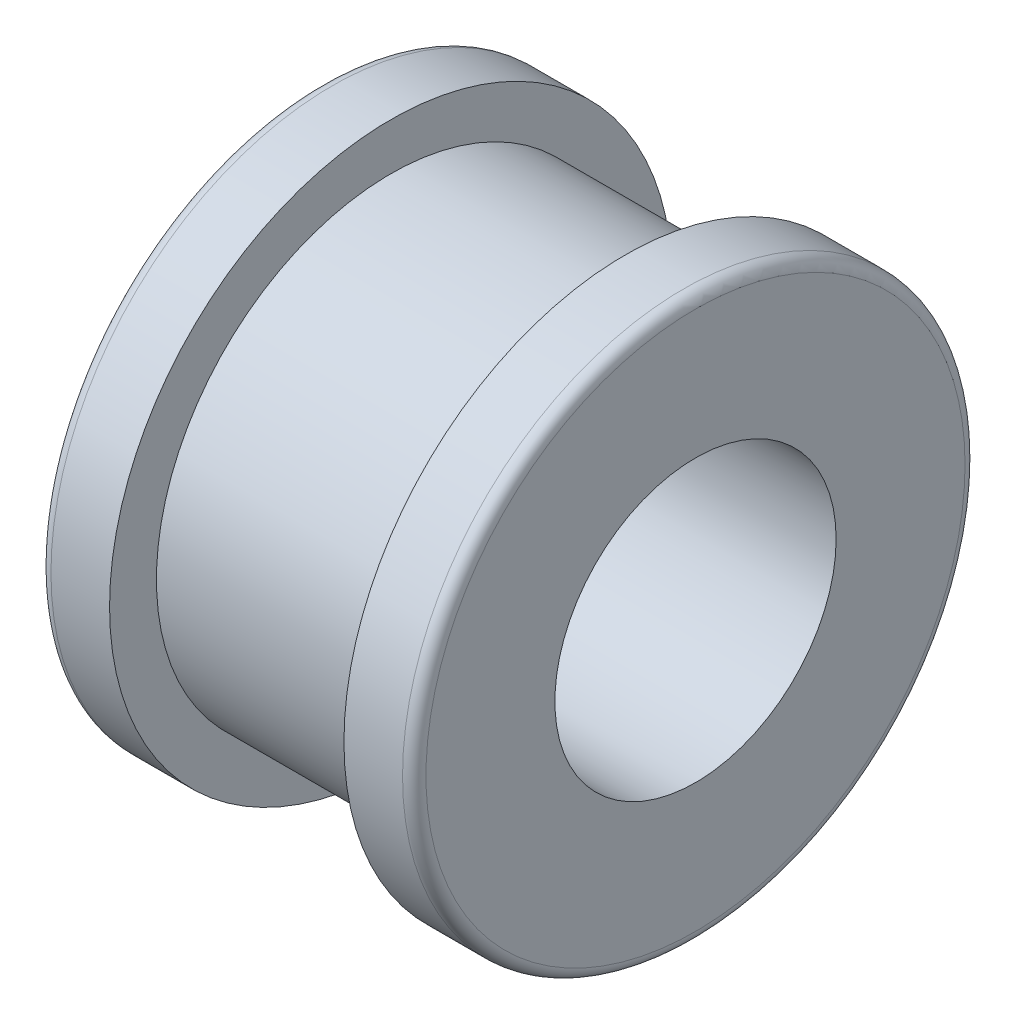
ISO-10303-21;
HEADER;
FILE_DESCRIPTION(('STEP AP214'),'2;1');
FILE_NAME('part.step','',(''),(''),'','','');
FILE_SCHEMA(('AUTOMOTIVE_DESIGN { 1 0 10303 214 1 1 1 1 }'));
ENDSEC;
DATA;
#1=APPLICATION_CONTEXT('core data for automotive mechanical design processes');
#2=APPLICATION_PROTOCOL_DEFINITION('international standard','automotive_design',2000,#1);
#3=PRODUCT_CONTEXT('',#1,'mechanical');
#4=PRODUCT('Part','Part','',(#3));
#5=PRODUCT_RELATED_PRODUCT_CATEGORY('part','',(#4));
#6=PRODUCT_DEFINITION_FORMATION('','',#4);
#7=PRODUCT_DEFINITION_CONTEXT('part definition',#1,'design');
#8=PRODUCT_DEFINITION('design','',#6,#7);
#9=PRODUCT_DEFINITION_SHAPE('','',#8);
#10=(LENGTH_UNIT() NAMED_UNIT(*) SI_UNIT(.MILLI.,.METRE.));
#11=(NAMED_UNIT(*) PLANE_ANGLE_UNIT() SI_UNIT($,.RADIAN.));
#12=(NAMED_UNIT(*) SI_UNIT($,.STERADIAN.) SOLID_ANGLE_UNIT());
#13=UNCERTAINTY_MEASURE_WITH_UNIT(LENGTH_MEASURE(1.E-05),#10,'distance_accuracy_value','');
#14=(GEOMETRIC_REPRESENTATION_CONTEXT(3) GLOBAL_UNCERTAINTY_ASSIGNED_CONTEXT((#13)) GLOBAL_UNIT_ASSIGNED_CONTEXT((#10,
#11,#12)) REPRESENTATION_CONTEXT('',''));
#15=CARTESIAN_POINT('',(0.,0.,0.));
#16=DIRECTION('',(0.,0.,1.));
#17=DIRECTION('',(1.,0.,0.));
#18=AXIS2_PLACEMENT_3D('',#15,#16,#17);
#19=CARTESIAN_POINT('',(8.,0.,0.));
#20=DIRECTION('',(-1.,0.,0.));
#21=DIRECTION('',(0.,0.,1.));
#22=AXIS2_PLACEMENT_3D('',#19,#20,#21);
#23=CYLINDRICAL_SURFACE('',#22,12.);
#24=CARTESIAN_POINT('',(-7.5,0.,0.));
#25=DIRECTION('',(1.,0.,0.));
#26=DIRECTION('',(0.,0.,-1.));
#27=AXIS2_PLACEMENT_3D('',#24,#25,#26);
#28=CIRCLE('',#27,12.);
#29=CARTESIAN_POINT('',(-7.5,0.,-12.));
#30=VERTEX_POINT('',#29);
#31=EDGE_CURVE('E54',#30,#30,#28,.T.);
#32=ORIENTED_EDGE('',*,*,#31,.T.);
#33=EDGE_LOOP('',(#32));
#34=FACE_BOUND('',#33,.T.);
#35=CARTESIAN_POINT('',(-5.,0.,0.));
#36=DIRECTION('',(1.,0.,0.));
#37=DIRECTION('',(0.,0.,-1.));
#38=AXIS2_PLACEMENT_3D('',#35,#36,#37);
#39=CIRCLE('',#38,12.);
#40=CARTESIAN_POINT('',(-5.,0.,-12.));
#41=VERTEX_POINT('',#40);
#42=EDGE_CURVE('E69',#41,#41,#39,.T.);
#43=ORIENTED_EDGE('',*,*,#42,.F.);
#44=EDGE_LOOP('',(#43));
#45=FACE_BOUND('',#44,.T.);
#46=ADVANCED_FACE('F40',(#34,#45),#23,.T.);
#47=CARTESIAN_POINT('',(-8.,0.,0.));
#48=DIRECTION('',(1.,0.,0.));
#49=DIRECTION('',(0.,0.,-1.));
#50=AXIS2_PLACEMENT_3D('',#47,#48,#49);
#51=PLANE('',#50);
#52=CARTESIAN_POINT('',(-8.,0.,0.));
#53=DIRECTION('',(1.,0.,0.));
#54=DIRECTION('',(0.,0.,-1.));
#55=AXIS2_PLACEMENT_3D('',#52,#53,#54);
#56=CIRCLE('',#55,11.5);
#57=CARTESIAN_POINT('',(-8.,0.,-11.5));
#58=VERTEX_POINT('',#57);
#59=EDGE_CURVE('E10',#58,#58,#56,.F.);
#60=ORIENTED_EDGE('',*,*,#59,.T.);
#61=EDGE_LOOP('',(#60));
#62=FACE_BOUND('',#61,.T.);
#63=CARTESIAN_POINT('',(-8.,0.,0.));
#64=DIRECTION('',(1.,0.,0.));
#65=DIRECTION('',(0.,0.,-1.));
#66=AXIS2_PLACEMENT_3D('',#63,#64,#65);
#67=CIRCLE('',#66,6.);
#68=CARTESIAN_POINT('',(-8.,0.,-6.));
#69=VERTEX_POINT('',#68);
#70=EDGE_CURVE('E82',#69,#69,#67,.T.);
#71=ORIENTED_EDGE('',*,*,#70,.T.);
#72=EDGE_LOOP('',(#71));
#73=FACE_BOUND('',#72,.T.);
#74=ADVANCED_FACE('F126',(#62,#73),#51,.F.);
#75=CARTESIAN_POINT('',(-5.,0.,0.));
#76=DIRECTION('',(1.,0.,0.));
#77=DIRECTION('',(0.,0.,-1.));
#78=AXIS2_PLACEMENT_3D('',#75,#76,#77);
#79=PLANE('',#78);
#80=CARTESIAN_POINT('',(-5.,0.,0.));
#81=DIRECTION('',(1.,0.,0.));
#82=DIRECTION('',(0.,0.,-1.));
#83=AXIS2_PLACEMENT_3D('',#80,#81,#82);
#84=CIRCLE('',#83,10.);
#85=CARTESIAN_POINT('',(-5.,0.,-10.));
#86=VERTEX_POINT('',#85);
#87=EDGE_CURVE('E74',#86,#86,#84,.T.);
#88=ORIENTED_EDGE('',*,*,#87,.F.);
#89=EDGE_LOOP('',(#88));
#90=FACE_BOUND('',#89,.T.);
#91=ORIENTED_EDGE('',*,*,#42,.T.);
#92=EDGE_LOOP('',(#91));
#93=FACE_BOUND('',#92,.T.);
#94=ADVANCED_FACE('F132',(#90,#93),#79,.T.);
#95=CARTESIAN_POINT('',(5.,0.,0.));
#96=DIRECTION('',(1.,0.,0.));
#97=DIRECTION('',(0.,0.,-1.));
#98=AXIS2_PLACEMENT_3D('',#95,#96,#97);
#99=PLANE('',#98);
#100=CARTESIAN_POINT('',(5.,0.,0.));
#101=DIRECTION('',(1.,0.,0.));
#102=DIRECTION('',(0.,0.,-1.));
#103=AXIS2_PLACEMENT_3D('',#100,#101,#102);
#104=CIRCLE('',#103,10.);
#105=CARTESIAN_POINT('',(5.,0.,-10.));
#106=VERTEX_POINT('',#105);
#107=EDGE_CURVE('E78',#106,#106,#104,.T.);
#108=ORIENTED_EDGE('',*,*,#107,.T.);
#109=EDGE_LOOP('',(#108));
#110=FACE_BOUND('',#109,.T.);
#111=CARTESIAN_POINT('',(5.,0.,0.));
#112=DIRECTION('',(1.,0.,0.));
#113=DIRECTION('',(0.,0.,-1.));
#114=AXIS2_PLACEMENT_3D('',#111,#112,#113);
#115=CIRCLE('',#114,12.);
#116=CARTESIAN_POINT('',(5.,0.,-12.));
#117=VERTEX_POINT('',#116);
#118=EDGE_CURVE('E70',#117,#117,#115,.T.);
#119=ORIENTED_EDGE('',*,*,#118,.F.);
#120=EDGE_LOOP('',(#119));
#121=FACE_BOUND('',#120,.T.);
#122=ADVANCED_FACE('F139',(#110,#121),#99,.F.);
#123=CARTESIAN_POINT('',(-5.,0.,0.));
#124=DIRECTION('',(1.,0.,0.));
#125=DIRECTION('',(0.,0.,-1.));
#126=AXIS2_PLACEMENT_3D('',#123,#124,#125);
#127=CYLINDRICAL_SURFACE('',#126,10.);
#128=CARTESIAN_POINT('',(1.,-10.,0.));
#129=CARTESIAN_POINT('',(0.99999757409962,-9.99999935520769,0.0560203537915572));
#130=CARTESIAN_POINT('',(0.995276731103556,-9.99952425596206,0.112077745167773));
#131=CARTESIAN_POINT('',(0.976515629709573,-9.99767467594738,0.222638398496837));
#132=CARTESIAN_POINT('',(0.962465103975411,-9.99629920434026,0.277139879168828));
#133=CARTESIAN_POINT('',(0.925457759402168,-9.9928041456307,0.382971675453414));
#134=CARTESIAN_POINT('',(0.902506319481526,-9.99068500800708,0.434303884614909));
#135=CARTESIAN_POINT('',(0.848359092068356,-9.98593957394306,0.532376160960406));
#136=CARTESIAN_POINT('',(0.817164943999862,-9.98331337838132,0.579117138779076));
#137=CARTESIAN_POINT('',(0.747297302337726,-9.97783744341324,0.666859550674082));
#138=CARTESIAN_POINT('',(0.708600200597966,-9.97498701573866,0.707842144834892));
#139=CARTESIAN_POINT('',(0.62487546573697,-9.96938956906263,0.782742521430984));
#140=CARTESIAN_POINT('',(0.579847539957613,-9.96664255484917,0.816659977082653));
#141=CARTESIAN_POINT('',(0.484621468316379,-9.96155591552784,0.876533970443617));
#142=CARTESIAN_POINT('',(0.434412555905142,-9.95921716710905,0.902473465454879));
#143=CARTESIAN_POINT('',(0.330324414095021,-9.95522037546525,0.94554638474276));
#144=CARTESIAN_POINT('',(0.27644527541605,-9.95356231542222,0.962680026591291));
#145=CARTESIAN_POINT('',(0.166738199133991,-9.95112084072978,0.987599041601893));
#146=CARTESIAN_POINT('',(0.110917423147792,-9.95033450398097,0.995415653003795));
#147=CARTESIAN_POINT('',(-0.00124886339578044,-9.94971643060526,1.00157528513536));
#148=CARTESIAN_POINT('',(-0.0575943601220591,-9.94988466888746,0.999918554870802));
#149=CARTESIAN_POINT('',(-0.168995309693318,-9.95115406898935,0.987204280252678));
#150=CARTESIAN_POINT('',(-0.224054699328694,-9.95225184590651,0.976180844124552));
#151=CARTESIAN_POINT('',(-0.331537963201094,-9.95525134287419,0.945099144150586));
#152=CARTESIAN_POINT('',(-0.383961801825031,-9.95715307378492,0.925040758255746));
#153=CARTESIAN_POINT('',(-0.484793587298889,-9.9615500945207,0.876420893881507));
#154=CARTESIAN_POINT('',(-0.533194189489316,-9.96404643908158,0.84784428271998));
#155=CARTESIAN_POINT('',(-0.624525214911882,-9.96935051732879,0.783010027353227));
#156=CARTESIAN_POINT('',(-0.667455477981763,-9.97215826012785,0.746752158336505));
#157=CARTESIAN_POINT('',(-0.746825393989027,-9.9777838531299,0.667394112412069));
#158=CARTESIAN_POINT('',(-0.783235601880805,-9.98060169332997,0.624264478851363));
#159=CARTESIAN_POINT('',(-0.848303632910388,-9.98591829078518,0.532489481737112));
#160=CARTESIAN_POINT('',(-0.876961447356476,-9.98841704768256,0.483844111999601));
#161=CARTESIAN_POINT('',(-0.925710020310253,-9.99281475667096,0.382398105692365));
#162=CARTESIAN_POINT('',(-0.945799284818062,-9.9947136041477,0.329596746389903));
#163=CARTESIAN_POINT('',(-0.976818916711752,-9.99769647441409,0.221347217329932));
#164=CARTESIAN_POINT('',(-0.987749557990623,-9.99878052157063,0.1658991267766));
#165=CARTESIAN_POINT('',(-1.00010430773477,-10.0000085166831,0.0541850990919041));
#166=CARTESIAN_POINT('',(-1.0015690482525,-10.0001564826774,-0.00207630210549165));
#167=CARTESIAN_POINT('',(-0.995057136951236,-9.99950641756797,-0.114043793315699));
#168=CARTESIAN_POINT('',(-0.98708061268472,-9.99870839924468,-0.16974989082047));
#169=CARTESIAN_POINT('',(-0.961946304578424,-9.99625861539194,-0.278908206834674));
#170=CARTESIAN_POINT('',(-0.944807545521989,-9.99460861918039,-0.332364848972019));
#171=CARTESIAN_POINT('',(-0.901854825962729,-9.99063998860609,-0.435644321383781));
#172=CARTESIAN_POINT('',(-0.876040670960603,-9.98832133925254,-0.485467070157117));
#173=CARTESIAN_POINT('',(-0.816369161336087,-9.98326475330422,-0.580248180172142));
#174=CARTESIAN_POINT('',(-0.782485111074183,-9.98052543603441,-0.625189659748917));
#175=CARTESIAN_POINT('',(-0.707673932259073,-9.9749393286952,-0.708761623311878));
#176=CARTESIAN_POINT('',(-0.666746626929683,-9.97209253592971,-0.747391948849177));
#177=CARTESIAN_POINT('',(-0.578833425340999,-9.96660024140755,-0.817386109887145));
#178=CARTESIAN_POINT('',(-0.531826243457378,-9.96395550138975,-0.848723278679543));
#179=CARTESIAN_POINT('',(-0.433192639853315,-9.9591783246089,-0.903058258743828));
#180=CARTESIAN_POINT('',(-0.381566281311604,-9.95704588084038,-0.926056184053882));
#181=CARTESIAN_POINT('',(-0.275251260534206,-9.9535394763405,-0.963015208684475));
#182=CARTESIAN_POINT('',(-0.220568159908879,-9.95216418449789,-0.976992174811861));
#183=CARTESIAN_POINT('',(-0.109616802039228,-9.95032365282877,-0.995564007129462));
#184=CARTESIAN_POINT('',(-0.0533485903043259,-9.94985838690186,-1.00015914239952));
#185=CARTESIAN_POINT('',(0.0589106883567047,-9.94989113107562,-0.999833138471256));
#186=CARTESIAN_POINT('',(0.114901882882815,-9.95038490087009,-0.994953889593112));
#187=CARTESIAN_POINT('',(0.225264917168288,-9.95227103889546,-0.975905452963653));
#188=CARTESIAN_POINT('',(0.27963675510598,-9.95366340813719,-0.96173625476216));
#189=CARTESIAN_POINT('',(0.385217349047857,-9.95718868263187,-0.924521686297503));
#190=CARTESIAN_POINT('',(0.436426541629725,-9.95932148540361,-0.901477544340916));
#191=CARTESIAN_POINT('',(0.534256891671035,-9.96408751839359,-0.847171554911043));
#192=CARTESIAN_POINT('',(0.58087807482063,-9.96672074580951,-0.815909753455415));
#193=CARTESIAN_POINT('',(0.668423674471935,-9.97220487209698,-0.745898556285331));
#194=CARTESIAN_POINT('',(0.709323076367086,-9.97505664726751,-0.707117948890268));
#195=CARTESIAN_POINT('',(0.784052232699658,-9.98064854728783,-0.623231699225109));
#196=CARTESIAN_POINT('',(0.81788029135717,-9.98338864522976,-0.578124544108257));
#197=CARTESIAN_POINT('',(0.877573453854621,-9.98845562069162,-0.482741434161289));
#198=CARTESIAN_POINT('',(0.903418290945183,-9.99078144026812,-0.432452749346764));
#199=CARTESIAN_POINT('',(0.946262422823868,-9.99474629249896,-0.328258279100551));
#200=CARTESIAN_POINT('',(0.963271690953547,-9.99638609909654,-0.274356649825609));
#201=CARTESIAN_POINT('',(0.983720617084802,-9.99838213773734,-0.183458261405704));
#202=CARTESIAN_POINT('',(0.989817044299357,-9.99898600691833,-0.147042552844509));
#203=CARTESIAN_POINT('',(0.997957526061762,-9.99979514950786,-0.073756580817313));
#204=CARTESIAN_POINT('',(1.00000159732186,-10.0000004245602,-0.0368863192265578));
#205=CARTESIAN_POINT('',(1.,-10.,0.));
#206=B_SPLINE_CURVE_WITH_KNOTS('',3,(#128,#129,#130,#131,#132,#133,#134,#135,#136,#137,#138,
#139,#140,#141,#142,#143,#144,#145,#146,#147,#148,#149,#150,#151,#152,#153,#154,#155,#156,#157,
#158,#159,#160,#161,#162,#163,#164,#165,#166,#167,#168,#169,#170,#171,#172,#173,#174,#175,#176,
#177,#178,#179,#180,#181,#182,#183,#184,#185,#186,#187,#188,#189,#190,#191,#192,#193,#194,#195,
#196,#197,#198,#199,#200,#201,#202,#203,#204,#205),.UNSPECIFIED.,.T.,.F.,(4,2,2,2,2,2,2,2,2,2,2,
2,2,2,2,2,2,2,2,2,2,2,2,2,2,2,2,2,2,2,2,2,2,2,2,2,2,2,4),(0.,0.167926366268474,
0.336037842835486,0.504047885732202,0.672024537582782,0.840538568622945,1.00906039220706,
1.17793975472222,1.34681494442504,1.51512232045197,1.68342527255776,1.8511179744111,
2.01881294161634,2.18680761372895,2.35480720331125,2.52354734196207,2.69228766979772,
2.86105740693581,3.02982209675439,3.19786188607758,3.36589940519143,3.53358935294305,
3.70128306049467,3.86953940748698,4.0377999781023,4.20666643608598,4.37553058475374,
4.54409690593003,4.71265839239585,4.88047629293956,5.04829438226039,5.216089253628,
5.3838831853896,5.55238917427653,5.72093552636958,5.88990631026242,6.05868594795295,
6.16925667232348,6.27982694069027),.UNSPECIFIED.);
#207=CARTESIAN_POINT('',(1.,-10.,0.));
#208=VERTEX_POINT('',#207);
#209=EDGE_CURVE('E93',#208,#208,#206,.T.);
#210=ORIENTED_EDGE('',*,*,#209,.F.);
#211=EDGE_LOOP('',(#210));
#212=FACE_BOUND('',#211,.T.);
#213=ORIENTED_EDGE('',*,*,#87,.T.);
#214=EDGE_LOOP('',(#213));
#215=FACE_BOUND('',#214,.T.);
#216=ORIENTED_EDGE('',*,*,#107,.F.);
#217=EDGE_LOOP('',(#216));
#218=FACE_BOUND('',#217,.T.);
#219=ADVANCED_FACE('F100',(#212,#215,#218),#127,.T.);
#220=CARTESIAN_POINT('',(8.,0.,0.));
#221=DIRECTION('',(1.,0.,0.));
#222=DIRECTION('',(0.,0.,-1.));
#223=AXIS2_PLACEMENT_3D('',#220,#221,#222);
#224=PLANE('',#223);
#225=CARTESIAN_POINT('',(8.,0.,0.));
#226=DIRECTION('',(1.,0.,0.));
#227=DIRECTION('',(0.,0.,-1.));
#228=AXIS2_PLACEMENT_3D('',#225,#226,#227);
#229=CIRCLE('',#228,11.5);
#230=CARTESIAN_POINT('',(8.,0.,-11.5));
#231=VERTEX_POINT('',#230);
#232=EDGE_CURVE('E65',#231,#231,#229,.T.);
#233=ORIENTED_EDGE('',*,*,#232,.T.);
#234=EDGE_LOOP('',(#233));
#235=FACE_BOUND('',#234,.T.);
#236=CARTESIAN_POINT('',(8.,0.,0.));
#237=DIRECTION('',(1.,0.,0.));
#238=DIRECTION('',(0.,0.,-1.));
#239=AXIS2_PLACEMENT_3D('',#236,#237,#238);
#240=CIRCLE('',#239,6.);
#241=CARTESIAN_POINT('',(8.,0.,-6.));
#242=VERTEX_POINT('',#241);
#243=EDGE_CURVE('E89',#242,#242,#240,.T.);
#244=ORIENTED_EDGE('',*,*,#243,.F.);
#245=EDGE_LOOP('',(#244));
#246=FACE_BOUND('',#245,.T.);
#247=ADVANCED_FACE('F120',(#235,#246),#224,.T.);
#248=CARTESIAN_POINT('',(7.5,0.,0.));
#249=DIRECTION('',(1.,0.,0.));
#250=DIRECTION('',(0.,0.,-1.));
#251=AXIS2_PLACEMENT_3D('',#248,#249,#250);
#252=CIRCLE('',#251,12.);
#253=CARTESIAN_POINT('',(7.5,0.,-12.));
#254=VERTEX_POINT('',#253);
#255=EDGE_CURVE('E59',#254,#254,#252,.F.);
#256=ORIENTED_EDGE('',*,*,#255,.T.);
#257=EDGE_LOOP('',(#256));
#258=FACE_BOUND('',#257,.T.);
#259=ORIENTED_EDGE('',*,*,#118,.T.);
#260=EDGE_LOOP('',(#259));
#261=FACE_BOUND('',#260,.T.);
#262=ADVANCED_FACE('F112',(#258,#261),#23,.T.);
#263=CARTESIAN_POINT('',(-8.,0.,0.));
#264=DIRECTION('',(1.,0.,0.));
#265=DIRECTION('',(0.,0.,-1.));
#266=AXIS2_PLACEMENT_3D('',#263,#264,#265);
#267=CYLINDRICAL_SURFACE('',#266,6.);
#268=CARTESIAN_POINT('',(0.,-5.91607978309962,1.));
#269=CARTESIAN_POINT('',(-0.0557502992584118,-5.91608078960511,0.999997759368402));
#270=CARTESIAN_POINT('',(-0.111531042409948,-5.91687637019227,0.995322067614928));
#271=CARTESIAN_POINT('',(-0.221527417288066,-5.91996982947271,0.976750971230157));
#272=CARTESIAN_POINT('',(-0.27574155749981,-5.92226909356571,0.962847064123861));
#273=CARTESIAN_POINT('',(-0.380996913342711,-5.9281024372893,0.926251817466857));
#274=CARTESIAN_POINT('',(-0.432040739466525,-5.9316354846878,0.903567821972435));
#275=CARTESIAN_POINT('',(-0.529592381885484,-5.93953708845736,0.850074598756146));
#276=CARTESIAN_POINT('',(-0.576100707830495,-5.94390555078989,0.819266285400627));
#277=CARTESIAN_POINT('',(-0.663725139898267,-5.95303388461044,0.75007501078652));
#278=CARTESIAN_POINT('',(-0.704790052554605,-5.95779686930827,0.711627619572909));
#279=CARTESIAN_POINT('',(-0.779917322744606,-5.96714992267783,0.628388801878136));
#280=CARTESIAN_POINT('',(-0.813979265246135,-5.97173998108788,0.583596999659995));
#281=CARTESIAN_POINT('',(-0.874325826887742,-5.98026294792988,0.488609147979335));
#282=CARTESIAN_POINT('',(-0.90056280309273,-5.98419176972911,0.438382432582681));
#283=CARTESIAN_POINT('',(-0.944208428212213,-5.99091494782862,0.334158248689549));
#284=CARTESIAN_POINT('',(-0.961617651153948,-5.9937093778907,0.280161025631276));
#285=CARTESIAN_POINT('',(-0.986957013993562,-5.99782693889752,0.170457490537697));
#286=CARTESIAN_POINT('',(-0.994973166401878,-5.99916341244362,0.114771554671708));
#287=CARTESIAN_POINT('',(-1.00156630166104,-6.00026031737113,0.00283011421031905));
#288=CARTESIAN_POINT('',(-1.00014392609889,-6.00002085587723,-0.0534253514115594));
#289=CARTESIAN_POINT('',(-0.987967459388716,-5.99800343372556,-0.16432087403155));
#290=CARTESIAN_POINT('',(-0.977305934636339,-5.99624073476959,-0.218971412280056));
#291=CARTESIAN_POINT('',(-0.947099570301403,-5.99139191508655,-0.325696791844717));
#292=CARTESIAN_POINT('',(-0.9275544601642,-5.98830575405284,-0.377771554660602));
#293=CARTESIAN_POINT('',(-0.880043743873873,-5.98113079404783,-0.478142459113059));
#294=CARTESIAN_POINT('',(-0.852039995167024,-5.97703746930752,-0.526420209207618));
#295=CARTESIAN_POINT('',(-0.78843487094598,-5.96830295228599,-0.617626211938657));
#296=CARTESIAN_POINT('',(-0.752832880515673,-5.96366171567654,-0.66055403116635));
#297=CARTESIAN_POINT('',(-0.674528477352277,-5.95428107293039,-0.740388509378666));
#298=CARTESIAN_POINT('',(-0.631745162039607,-5.94954115892417,-0.777215800901283));
#299=CARTESIAN_POINT('',(-0.540565163913672,-5.94055183913922,-0.843181835379226));
#300=CARTESIAN_POINT('',(-0.492168429326872,-5.9363024378853,-0.872320507412967));
#301=CARTESIAN_POINT('',(-0.391043343249008,-5.92877501824727,-0.922097773795314));
#302=CARTESIAN_POINT('',(-0.338310200763164,-5.92549809321041,-0.942726810911697));
#303=CARTESIAN_POINT('',(-0.230060371076983,-5.92030475475952,-0.974811948326247));
#304=CARTESIAN_POINT('',(-0.174543929427031,-5.91838822155329,-0.986268856307182));
#305=CARTESIAN_POINT('',(-0.0630135375351475,-5.91615583768847,-0.999572753951706));
#306=CARTESIAN_POINT('',(-0.00701344811915934,-5.91582114303468,-1.00153288316498));
#307=CARTESIAN_POINT('',(0.104514668676328,-5.91674013912945,-0.996089081072983));
#308=CARTESIAN_POINT('',(0.160042714205589,-5.91799376852741,-0.988685511449866));
#309=CARTESIAN_POINT('',(0.268691103676343,-5.92193074982007,-0.964820933971239));
#310=CARTESIAN_POINT('',(0.321824455951204,-5.92460500767339,-0.948417516258554));
#311=CARTESIAN_POINT('',(0.424588066511794,-5.93107429202201,-0.907079276076911));
#312=CARTESIAN_POINT('',(0.474218115020361,-5.93486938556232,-0.882143943240374));
#313=CARTESIAN_POINT('',(0.569069837762444,-5.94319651358957,-0.824182669291691));
#314=CARTESIAN_POINT('',(0.614246629102423,-5.94773502240139,-0.791084225663745));
#315=CARTESIAN_POINT('',(0.698445413078001,-5.95701866671947,-0.717835786283193));
#316=CARTESIAN_POINT('',(0.737466972443896,-5.96176381674133,-0.677685294553618));
#317=CARTESIAN_POINT('',(0.808660757091481,-5.97098568847306,-0.590971228131524));
#318=CARTESIAN_POINT('',(0.840757530513817,-5.97545910537869,-0.544345301354478));
#319=CARTESIAN_POINT('',(0.896662130801952,-5.98358044973177,-0.44629737917973));
#320=CARTESIAN_POINT('',(0.92047022578954,-5.9872284038799,-0.394875538988251));
#321=CARTESIAN_POINT('',(0.959004233581946,-5.99327343267833,-0.288919620600531));
#322=CARTESIAN_POINT('',(0.973769630293967,-5.99567593827049,-0.234400225041044));
#323=CARTESIAN_POINT('',(0.993926239585532,-5.99898233267713,-0.123612293949685));
#324=CARTESIAN_POINT('',(0.999318223492944,-5.99988634480071,-0.0673439027286497));
#325=CARTESIAN_POINT('',(1.00055275292488,-6.0000921515513,0.044616510309472));
#326=CARTESIAN_POINT('',(0.996510101576422,-5.99941320809696,0.100307264241071));
#327=CARTESIAN_POINT('',(0.97923843109224,-5.99656871354913,0.210204789725876));
#328=CARTESIAN_POINT('',(0.966009463396175,-5.99440317078001,0.26441156958697));
#329=CARTESIAN_POINT('',(0.930784733782497,-5.98882795531034,0.369758578367437));
#330=CARTESIAN_POINT('',(0.908798732715821,-5.98541966816622,0.420902148861609));
#331=CARTESIAN_POINT('',(0.856696825507926,-5.97773102750941,0.518792181192786));
#332=CARTESIAN_POINT('',(0.826580533975613,-5.97345063265953,0.565538434446986));
#333=CARTESIAN_POINT('',(0.758665963015201,-5.96443051847589,0.653885178210864));
#334=CARTESIAN_POINT('',(0.72078361809725,-5.95968609820294,0.695420572242245));
#335=CARTESIAN_POINT('',(0.638588676840723,-5.95030521321901,0.771585550379217));
#336=CARTESIAN_POINT('',(0.594274576443382,-5.94566877405441,0.806213514680476));
#337=CARTESIAN_POINT('',(0.500101870996945,-5.93699337428039,0.867805708367845));
#338=CARTESIAN_POINT('',(0.450206264064781,-5.93295887192494,0.894713995637815));
#339=CARTESIAN_POINT('',(0.346556305635426,-5.92599684088708,0.939725814576364));
#340=CARTESIAN_POINT('',(0.292805870921243,-5.92306820700509,0.95783814209264));
#341=CARTESIAN_POINT('',(0.199038492209334,-5.91929897935112,0.980810421248857));
#342=CARTESIAN_POINT('',(0.159589276816625,-5.91809849368407,0.987994967068111));
#343=CARTESIAN_POINT('',(0.0800986060635565,-5.91648854114608,0.997590518072968));
#344=CARTESIAN_POINT('',(0.0400571614679344,-5.91607905991511,1.00000160991677));
#345=CARTESIAN_POINT('',(0.,-5.91607978309962,1.));
#346=B_SPLINE_CURVE_WITH_KNOTS('',3,(#268,#269,#270,#271,#272,#273,#274,#275,#276,#277,#278,
#279,#280,#281,#282,#283,#284,#285,#286,#287,#288,#289,#290,#291,#292,#293,#294,#295,#296,#297,
#298,#299,#300,#301,#302,#303,#304,#305,#306,#307,#308,#309,#310,#311,#312,#313,#314,#315,#316,
#317,#318,#319,#320,#321,#322,#323,#324,#325,#326,#327,#328,#329,#330,#331,#332,#333,#334,#335,
#336,#337,#338,#339,#340,#341,#342,#343,#344,#345),.UNSPECIFIED.,.T.,.F.,(4,2,2,2,2,2,2,2,2,2,2,
2,2,2,2,2,2,2,2,2,2,2,2,2,2,2,2,2,2,2,2,2,2,2,2,2,2,2,4),(0.,0.167104415562128,
0.334363007967779,0.501481999132666,0.668582189603687,0.83715663660545,1.00574107132038,
1.17533192042833,1.34491174042704,1.51292626987285,1.68092937859336,1.84726848464127,
2.01361265698072,2.18071841654029,2.34783770488965,2.51698449383108,2.68613284296667,
2.85547064997701,3.0247935437349,3.19209416966423,3.3593883336385,3.52562425852456,
3.69187012915689,3.8596493710334,4.02744041770535,4.19697645212412,4.36650700188938,
4.53529193765317,4.70406298363199,4.87079110504626,5.03751829285788,5.20406015931242,
5.37060992155193,5.5390679898356,5.70756551550984,5.8772549104514,6.04677426695051,
6.16684268214775,6.28690891757997),.UNSPECIFIED.);
#347=CARTESIAN_POINT('',(0.,-5.91607978309962,1.));
#348=VERTEX_POINT('',#347);
#349=EDGE_CURVE('E44',#348,#348,#346,.T.);
#350=ORIENTED_EDGE('',*,*,#349,.T.);
#351=EDGE_LOOP('',(#350));
#352=FACE_BOUND('',#351,.T.);
#353=ORIENTED_EDGE('',*,*,#70,.F.);
#354=EDGE_LOOP('',(#353));
#355=FACE_BOUND('',#354,.T.);
#356=ORIENTED_EDGE('',*,*,#243,.T.);
#357=EDGE_LOOP('',(#356));
#358=FACE_BOUND('',#357,.T.);
#359=ADVANCED_FACE('F107',(#352,#355,#358),#267,.F.);
#360=CARTESIAN_POINT('',(7.5,0.,0.));
#361=DIRECTION('',(1.,0.,0.));
#362=DIRECTION('',(0.,0.,-1.));
#363=AXIS2_PLACEMENT_3D('',#360,#361,#362);
#364=TOROIDAL_SURFACE('',#363,11.5,0.5);
#365=ORIENTED_EDGE('',*,*,#255,.F.);
#366=EDGE_LOOP('',(#365));
#367=FACE_BOUND('',#366,.T.);
#368=ORIENTED_EDGE('',*,*,#232,.F.);
#369=EDGE_LOOP('',(#368));
#370=FACE_BOUND('',#369,.T.);
#371=ADVANCED_FACE('F111',(#367,#370),#364,.T.);
#372=CARTESIAN_POINT('',(-7.5,0.,0.));
#373=DIRECTION('',(1.,0.,0.));
#374=DIRECTION('',(0.,0.,-1.));
#375=AXIS2_PLACEMENT_3D('',#372,#373,#374);
#376=TOROIDAL_SURFACE('',#375,11.5,0.5);
#377=ORIENTED_EDGE('',*,*,#59,.F.);
#378=EDGE_LOOP('',(#377));
#379=FACE_BOUND('',#378,.T.);
#380=ORIENTED_EDGE('',*,*,#31,.F.);
#381=EDGE_LOOP('',(#380));
#382=FACE_BOUND('',#381,.T.);
#383=ADVANCED_FACE('F42',(#379,#382),#376,.T.);
#384=CARTESIAN_POINT('',(0.,-10.,0.));
#385=DIRECTION('',(0.,1.,0.));
#386=DIRECTION('',(0.,0.,1.));
#387=AXIS2_PLACEMENT_3D('',#384,#385,#386);
#388=CYLINDRICAL_SURFACE('',#387,1.);
#389=ORIENTED_EDGE('',*,*,#209,.T.);
#390=EDGE_LOOP('',(#389));
#391=FACE_BOUND('',#390,.T.);
#392=ORIENTED_EDGE('',*,*,#349,.F.);
#393=EDGE_LOOP('',(#392));
#394=FACE_BOUND('',#393,.T.);
#395=ADVANCED_FACE('F103',(#391,#394),#388,.F.);
#396=CLOSED_SHELL('',(#46,#74,#94,#122,#219,#247,#262,#359,#371,#383,#395));
#397=MANIFOLD_SOLID_BREP('B2',#396);
#398=ADVANCED_BREP_SHAPE_REPRESENTATION('',(#18,#397),#14);
#399=SHAPE_DEFINITION_REPRESENTATION(#9,#398);
ENDSEC;
END-ISO-10303-21;
